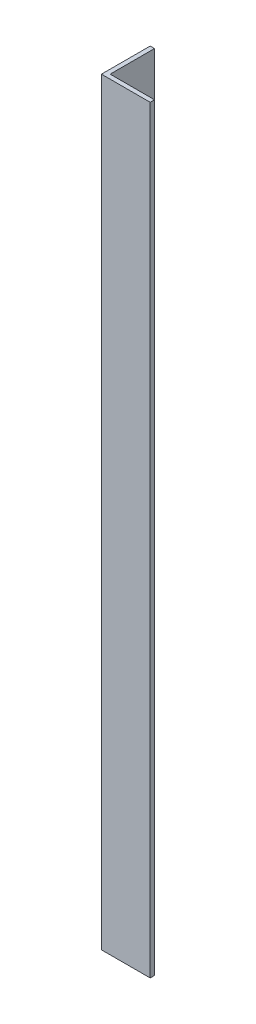
ISO-10303-21;
HEADER;
FILE_DESCRIPTION(('STEP AP214'),'2;1');
FILE_NAME('part.step','',(''),(''),'','','');
FILE_SCHEMA(('AUTOMOTIVE_DESIGN { 1 0 10303 214 1 1 1 1 }'));
ENDSEC;
DATA;
#1=APPLICATION_CONTEXT('core data for automotive mechanical design processes');
#2=APPLICATION_PROTOCOL_DEFINITION('international standard','automotive_design',2000,#1);
#3=PRODUCT_CONTEXT('',#1,'mechanical');
#4=PRODUCT('Part','Part','',(#3));
#5=PRODUCT_RELATED_PRODUCT_CATEGORY('part','',(#4));
#6=PRODUCT_DEFINITION_FORMATION('','',#4);
#7=PRODUCT_DEFINITION_CONTEXT('part definition',#1,'design');
#8=PRODUCT_DEFINITION('design','',#6,#7);
#9=PRODUCT_DEFINITION_SHAPE('','',#8);
#10=(LENGTH_UNIT() NAMED_UNIT(*) SI_UNIT(.MILLI.,.METRE.));
#11=(NAMED_UNIT(*) PLANE_ANGLE_UNIT() SI_UNIT($,.RADIAN.));
#12=(NAMED_UNIT(*) SI_UNIT($,.STERADIAN.) SOLID_ANGLE_UNIT());
#13=UNCERTAINTY_MEASURE_WITH_UNIT(LENGTH_MEASURE(1.E-05),#10,'distance_accuracy_value','');
#14=(GEOMETRIC_REPRESENTATION_CONTEXT(3) GLOBAL_UNCERTAINTY_ASSIGNED_CONTEXT((#13)) GLOBAL_UNIT_ASSIGNED_CONTEXT((#10,
#11,#12)) REPRESENTATION_CONTEXT('',''));
#15=CARTESIAN_POINT('',(0.,0.,0.));
#16=DIRECTION('',(0.,0.,1.));
#17=DIRECTION('',(1.,0.,0.));
#18=AXIS2_PLACEMENT_3D('',#15,#16,#17);
#19=CARTESIAN_POINT('',(0.,700.,0.));
#20=DIRECTION('',(0.,0.,-1.));
#21=DIRECTION('',(-1.,0.,0.));
#22=AXIS2_PLACEMENT_3D('',#19,#20,#21);
#23=PLANE('',#22);
#24=DIRECTION('',(1.,0.,0.));
#25=VECTOR('',#24,1.);
#26=CARTESIAN_POINT('',(0.,0.,0.));
#27=LINE('',#26,#25);
#28=CARTESIAN_POINT('',(0.,0.,0.));
#29=VERTEX_POINT('',#28);
#30=CARTESIAN_POINT('',(45.,0.,0.));
#31=VERTEX_POINT('',#30);
#32=EDGE_CURVE('E115',#29,#31,#27,.T.);
#33=ORIENTED_EDGE('',*,*,#32,.T.);
#34=DIRECTION('',(0.,-1.,0.));
#35=VECTOR('',#34,1.);
#36=CARTESIAN_POINT('',(45.,700.,0.));
#37=LINE('',#36,#35);
#38=CARTESIAN_POINT('',(45.,700.,0.));
#39=VERTEX_POINT('',#38);
#40=EDGE_CURVE('E11',#39,#31,#37,.T.);
#41=ORIENTED_EDGE('',*,*,#40,.F.);
#42=DIRECTION('',(1.,0.,0.));
#43=VECTOR('',#42,1.);
#44=CARTESIAN_POINT('',(0.,700.,0.));
#45=LINE('',#44,#43);
#46=CARTESIAN_POINT('',(0.,700.,0.));
#47=VERTEX_POINT('',#46);
#48=EDGE_CURVE('E80',#47,#39,#45,.T.);
#49=ORIENTED_EDGE('',*,*,#48,.F.);
#50=DIRECTION('',(0.,-1.,0.));
#51=VECTOR('',#50,1.);
#52=CARTESIAN_POINT('',(0.,700.,0.));
#53=LINE('',#52,#51);
#54=EDGE_CURVE('E111',#47,#29,#53,.T.);
#55=ORIENTED_EDGE('',*,*,#54,.T.);
#56=EDGE_LOOP('',(#33,#41,#49,#55));
#57=FACE_BOUND('',#56,.T.);
#58=ADVANCED_FACE('F34',(#57),#23,.F.);
#59=CARTESIAN_POINT('',(45.,700.,-4.));
#60=DIRECTION('',(1.,0.,0.));
#61=DIRECTION('',(0.,0.,-1.));
#62=AXIS2_PLACEMENT_3D('',#59,#60,#61);
#63=PLANE('',#62);
#64=DIRECTION('',(0.,0.,1.));
#65=VECTOR('',#64,1.);
#66=CARTESIAN_POINT('',(45.,0.,-4.));
#67=LINE('',#66,#65);
#68=CARTESIAN_POINT('',(45.,0.,-4.));
#69=VERTEX_POINT('',#68);
#70=EDGE_CURVE('E118',#69,#31,#67,.T.);
#71=ORIENTED_EDGE('',*,*,#70,.F.);
#72=DIRECTION('',(0.,-1.,0.));
#73=VECTOR('',#72,1.);
#74=CARTESIAN_POINT('',(45.,700.,-4.));
#75=LINE('',#74,#73);
#76=CARTESIAN_POINT('',(45.,700.,-4.));
#77=VERTEX_POINT('',#76);
#78=EDGE_CURVE('E42',#77,#69,#75,.T.);
#79=ORIENTED_EDGE('',*,*,#78,.F.);
#80=DIRECTION('',(0.,0.,1.));
#81=VECTOR('',#80,1.);
#82=CARTESIAN_POINT('',(45.,700.,-4.));
#83=LINE('',#82,#81);
#84=EDGE_CURVE('E204',#77,#39,#83,.T.);
#85=ORIENTED_EDGE('',*,*,#84,.T.);
#86=ORIENTED_EDGE('',*,*,#40,.T.);
#87=EDGE_LOOP('',(#71,#79,#85,#86));
#88=FACE_BOUND('',#87,.T.);
#89=ADVANCED_FACE('F136',(#88),#63,.T.);
#90=CARTESIAN_POINT('',(0.,700.,-4.));
#91=DIRECTION('',(0.,0.,-1.));
#92=DIRECTION('',(-1.,0.,0.));
#93=AXIS2_PLACEMENT_3D('',#90,#91,#92);
#94=PLANE('',#93);
#95=DIRECTION('',(1.,0.,0.));
#96=VECTOR('',#95,1.);
#97=CARTESIAN_POINT('',(0.,0.,-4.));
#98=LINE('',#97,#96);
#99=CARTESIAN_POINT('',(4.,0.,-4.));
#100=VERTEX_POINT('',#99);
#101=EDGE_CURVE('E121',#100,#69,#98,.T.);
#102=ORIENTED_EDGE('',*,*,#101,.F.);
#103=DIRECTION('',(0.,-1.,0.));
#104=VECTOR('',#103,1.);
#105=CARTESIAN_POINT('',(4.,700.,-4.));
#106=LINE('',#105,#104);
#107=CARTESIAN_POINT('',(4.,700.,-4.));
#108=VERTEX_POINT('',#107);
#109=EDGE_CURVE('E101',#108,#100,#106,.T.);
#110=ORIENTED_EDGE('',*,*,#109,.F.);
#111=DIRECTION('',(1.,0.,0.));
#112=VECTOR('',#111,1.);
#113=CARTESIAN_POINT('',(0.,700.,-4.));
#114=LINE('',#113,#112);
#115=EDGE_CURVE('E107',#108,#77,#114,.T.);
#116=ORIENTED_EDGE('',*,*,#115,.T.);
#117=ORIENTED_EDGE('',*,*,#78,.T.);
#118=EDGE_LOOP('',(#102,#110,#116,#117));
#119=FACE_BOUND('',#118,.T.);
#120=ADVANCED_FACE('F133',(#119),#94,.T.);
#121=CARTESIAN_POINT('',(4.,700.,-45.));
#122=DIRECTION('',(1.,0.,0.));
#123=DIRECTION('',(0.,0.,-1.));
#124=AXIS2_PLACEMENT_3D('',#121,#122,#123);
#125=PLANE('',#124);
#126=DIRECTION('',(0.,0.,1.));
#127=VECTOR('',#126,1.);
#128=CARTESIAN_POINT('',(4.,0.,-45.));
#129=LINE('',#128,#127);
#130=CARTESIAN_POINT('',(4.,0.,-45.));
#131=VERTEX_POINT('',#130);
#132=EDGE_CURVE('E96',#131,#100,#129,.T.);
#133=ORIENTED_EDGE('',*,*,#132,.F.);
#134=DIRECTION('',(0.,-1.,0.));
#135=VECTOR('',#134,1.);
#136=CARTESIAN_POINT('',(4.,700.,-45.));
#137=LINE('',#136,#135);
#138=CARTESIAN_POINT('',(4.,700.,-45.));
#139=VERTEX_POINT('',#138);
#140=EDGE_CURVE('E91',#139,#131,#137,.T.);
#141=ORIENTED_EDGE('',*,*,#140,.F.);
#142=DIRECTION('',(0.,0.,1.));
#143=VECTOR('',#142,1.);
#144=CARTESIAN_POINT('',(4.,700.,-45.));
#145=LINE('',#144,#143);
#146=EDGE_CURVE('E94',#139,#108,#145,.T.);
#147=ORIENTED_EDGE('',*,*,#146,.T.);
#148=ORIENTED_EDGE('',*,*,#109,.T.);
#149=EDGE_LOOP('',(#133,#141,#147,#148));
#150=FACE_BOUND('',#149,.T.);
#151=ADVANCED_FACE('F93',(#150),#125,.T.);
#152=CARTESIAN_POINT('',(0.,700.,-45.));
#153=DIRECTION('',(0.,0.,-1.));
#154=DIRECTION('',(-1.,0.,0.));
#155=AXIS2_PLACEMENT_3D('',#152,#153,#154);
#156=PLANE('',#155);
#157=DIRECTION('',(1.,0.,0.));
#158=VECTOR('',#157,1.);
#159=CARTESIAN_POINT('',(0.,0.,-45.));
#160=LINE('',#159,#158);
#161=CARTESIAN_POINT('',(0.,0.,-45.));
#162=VERTEX_POINT('',#161);
#163=EDGE_CURVE('E125',#162,#131,#160,.T.);
#164=ORIENTED_EDGE('',*,*,#163,.F.);
#165=DIRECTION('',(0.,-1.,0.));
#166=VECTOR('',#165,1.);
#167=CARTESIAN_POINT('',(0.,700.,-45.));
#168=LINE('',#167,#166);
#169=CARTESIAN_POINT('',(0.,700.,-45.));
#170=VERTEX_POINT('',#169);
#171=EDGE_CURVE('E71',#170,#162,#168,.T.);
#172=ORIENTED_EDGE('',*,*,#171,.F.);
#173=DIRECTION('',(1.,0.,0.));
#174=VECTOR('',#173,1.);
#175=CARTESIAN_POINT('',(0.,700.,-45.));
#176=LINE('',#175,#174);
#177=EDGE_CURVE('E105',#170,#139,#176,.T.);
#178=ORIENTED_EDGE('',*,*,#177,.T.);
#179=ORIENTED_EDGE('',*,*,#140,.T.);
#180=EDGE_LOOP('',(#164,#172,#178,#179));
#181=FACE_BOUND('',#180,.T.);
#182=ADVANCED_FACE('F109',(#181),#156,.T.);
#183=CARTESIAN_POINT('',(0.,700.,-45.));
#184=DIRECTION('',(1.,0.,0.));
#185=DIRECTION('',(0.,0.,-1.));
#186=AXIS2_PLACEMENT_3D('',#183,#184,#185);
#187=PLANE('',#186);
#188=DIRECTION('',(0.,0.,1.));
#189=VECTOR('',#188,1.);
#190=CARTESIAN_POINT('',(0.,0.,-45.));
#191=LINE('',#190,#189);
#192=EDGE_CURVE('E74',#162,#29,#191,.T.);
#193=ORIENTED_EDGE('',*,*,#192,.T.);
#194=ORIENTED_EDGE('',*,*,#54,.F.);
#195=DIRECTION('',(0.,0.,1.));
#196=VECTOR('',#195,1.);
#197=CARTESIAN_POINT('',(0.,700.,-45.));
#198=LINE('',#197,#196);
#199=EDGE_CURVE('E50',#170,#47,#198,.T.);
#200=ORIENTED_EDGE('',*,*,#199,.F.);
#201=ORIENTED_EDGE('',*,*,#171,.T.);
#202=EDGE_LOOP('',(#193,#194,#200,#201));
#203=FACE_BOUND('',#202,.T.);
#204=ADVANCED_FACE('F141',(#203),#187,.F.);
#205=CARTESIAN_POINT('',(0.,700.,0.));
#206=DIRECTION('',(0.,-1.,0.));
#207=DIRECTION('',(-1.,0.,0.));
#208=AXIS2_PLACEMENT_3D('',#205,#206,#207);
#209=PLANE('',#208);
#210=ORIENTED_EDGE('',*,*,#48,.T.);
#211=ORIENTED_EDGE('',*,*,#84,.F.);
#212=ORIENTED_EDGE('',*,*,#115,.F.);
#213=ORIENTED_EDGE('',*,*,#146,.F.);
#214=ORIENTED_EDGE('',*,*,#177,.F.);
#215=ORIENTED_EDGE('',*,*,#199,.T.);
#216=EDGE_LOOP('',(#210,#211,#212,#213,#214,#215));
#217=FACE_BOUND('',#216,.T.);
#218=ADVANCED_FACE('F104',(#217),#209,.F.);
#219=CARTESIAN_POINT('',(0.,0.,0.));
#220=DIRECTION('',(0.,-1.,0.));
#221=DIRECTION('',(-1.,0.,0.));
#222=AXIS2_PLACEMENT_3D('',#219,#220,#221);
#223=PLANE('',#222);
#224=ORIENTED_EDGE('',*,*,#32,.F.);
#225=ORIENTED_EDGE('',*,*,#192,.F.);
#226=ORIENTED_EDGE('',*,*,#163,.T.);
#227=ORIENTED_EDGE('',*,*,#132,.T.);
#228=ORIENTED_EDGE('',*,*,#101,.T.);
#229=ORIENTED_EDGE('',*,*,#70,.T.);
#230=EDGE_LOOP('',(#224,#225,#226,#227,#228,#229));
#231=FACE_BOUND('',#230,.T.);
#232=ADVANCED_FACE('F139',(#231),#223,.T.);
#233=CLOSED_SHELL('',(#58,#89,#120,#151,#182,#204,#218,#232));
#234=MANIFOLD_SOLID_BREP('B2',#233);
#235=ADVANCED_BREP_SHAPE_REPRESENTATION('',(#18,#234),#14);
#236=SHAPE_DEFINITION_REPRESENTATION(#9,#235);
ENDSEC;
END-ISO-10303-21;
